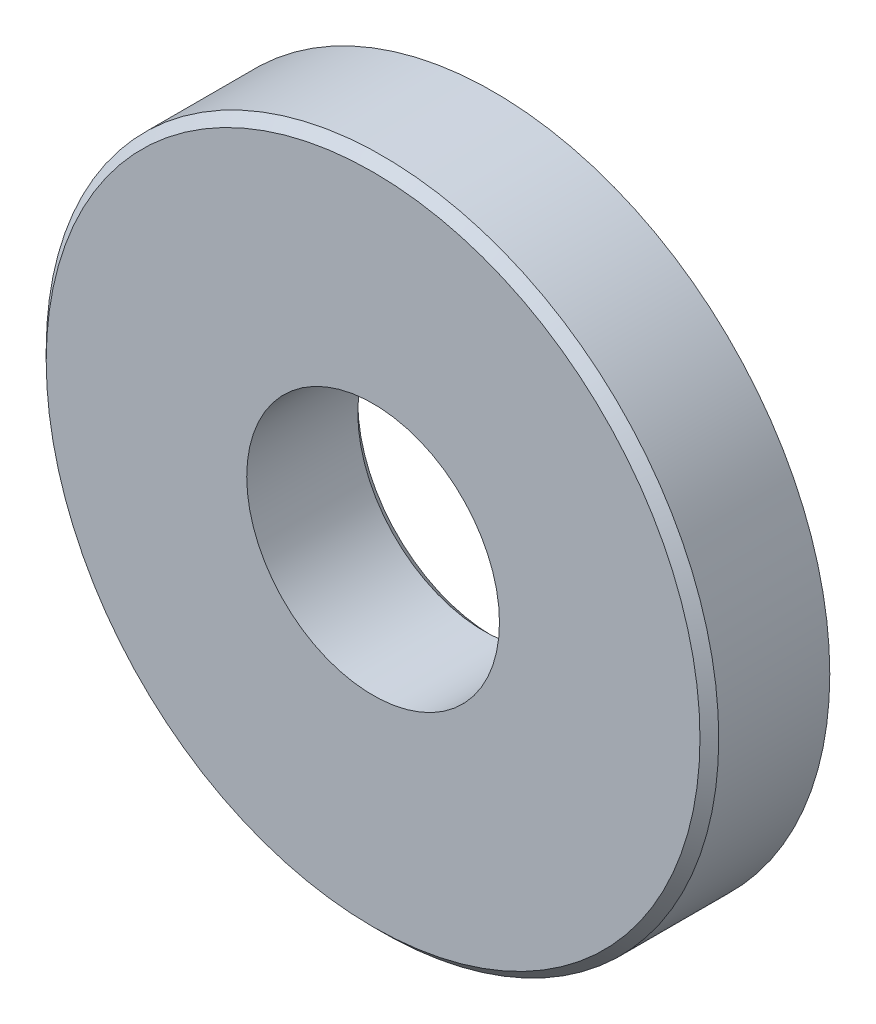
ISO-10303-21;
HEADER;
FILE_DESCRIPTION(('STEP AP214'),'2;1');
FILE_NAME('part.step','',(''),(''),'','','');
FILE_SCHEMA(('AUTOMOTIVE_DESIGN { 1 0 10303 214 1 1 1 1 }'));
ENDSEC;
DATA;
#1=APPLICATION_CONTEXT('core data for automotive mechanical design processes');
#2=APPLICATION_PROTOCOL_DEFINITION('international standard','automotive_design',2000,#1);
#3=PRODUCT_CONTEXT('',#1,'mechanical');
#4=PRODUCT('Part','Part','',(#3));
#5=PRODUCT_RELATED_PRODUCT_CATEGORY('part','',(#4));
#6=PRODUCT_DEFINITION_FORMATION('','',#4);
#7=PRODUCT_DEFINITION_CONTEXT('part definition',#1,'design');
#8=PRODUCT_DEFINITION('design','',#6,#7);
#9=PRODUCT_DEFINITION_SHAPE('','',#8);
#10=(LENGTH_UNIT() NAMED_UNIT(*) SI_UNIT(.MILLI.,.METRE.));
#11=(NAMED_UNIT(*) PLANE_ANGLE_UNIT() SI_UNIT($,.RADIAN.));
#12=(NAMED_UNIT(*) SI_UNIT($,.STERADIAN.) SOLID_ANGLE_UNIT());
#13=UNCERTAINTY_MEASURE_WITH_UNIT(LENGTH_MEASURE(1.E-05),#10,'distance_accuracy_value','');
#14=(GEOMETRIC_REPRESENTATION_CONTEXT(3) GLOBAL_UNCERTAINTY_ASSIGNED_CONTEXT((#13)) GLOBAL_UNIT_ASSIGNED_CONTEXT((#10,
#11,#12)) REPRESENTATION_CONTEXT('',''));
#15=CARTESIAN_POINT('',(0.,0.,0.));
#16=DIRECTION('',(0.,0.,1.));
#17=DIRECTION('',(1.,0.,0.));
#18=AXIS2_PLACEMENT_3D('',#15,#16,#17);
#19=CARTESIAN_POINT('',(0.,0.,3.85));
#20=DIRECTION('',(0.,0.,1.));
#21=DIRECTION('',(1.,0.,0.));
#22=AXIS2_PLACEMENT_3D('',#19,#20,#21);
#23=PLANE('',#22);
#24=CARTESIAN_POINT('',(0.,0.,3.85));
#25=DIRECTION('',(0.,0.,1.));
#26=DIRECTION('',(1.,0.,0.));
#27=AXIS2_PLACEMENT_3D('',#24,#25,#26);
#28=CIRCLE('',#27,10.45);
#29=CARTESIAN_POINT('',(10.45,0.,3.85));
#30=VERTEX_POINT('',#29);
#31=EDGE_CURVE('E66',#30,#30,#28,.T.);
#32=ORIENTED_EDGE('',*,*,#31,.T.);
#33=EDGE_LOOP('',(#32));
#34=FACE_BOUND('',#33,.T.);
#35=CARTESIAN_POINT('',(0.,0.,3.85));
#36=DIRECTION('',(0.,0.,1.));
#37=DIRECTION('',(1.,0.,0.));
#38=AXIS2_PLACEMENT_3D('',#35,#36,#37);
#39=CIRCLE('',#38,4.04);
#40=CARTESIAN_POINT('',(4.04,0.,3.85));
#41=VERTEX_POINT('',#40);
#42=EDGE_CURVE('E74',#41,#41,#39,.T.);
#43=ORIENTED_EDGE('',*,*,#42,.F.);
#44=EDGE_LOOP('',(#43));
#45=FACE_BOUND('',#44,.T.);
#46=ADVANCED_FACE('F43',(#34,#45),#23,.T.);
#47=CARTESIAN_POINT('',(0.,0.,0.));
#48=DIRECTION('',(0.,0.,1.));
#49=DIRECTION('',(1.,0.,0.));
#50=AXIS2_PLACEMENT_3D('',#47,#48,#49);
#51=PLANE('',#50);
#52=CARTESIAN_POINT('',(0.,0.,0.));
#53=DIRECTION('',(0.,0.,1.));
#54=DIRECTION('',(1.,0.,0.));
#55=AXIS2_PLACEMENT_3D('',#52,#53,#54);
#56=CIRCLE('',#55,4.33999999999999);
#57=CARTESIAN_POINT('',(4.33999999999999,0.,0.));
#58=VERTEX_POINT('',#57);
#59=EDGE_CURVE('E52',#58,#58,#56,.T.);
#60=ORIENTED_EDGE('',*,*,#59,.T.);
#61=EDGE_LOOP('',(#60));
#62=FACE_BOUND('',#61,.T.);
#63=CARTESIAN_POINT('',(0.,0.,0.));
#64=DIRECTION('',(0.,0.,1.));
#65=DIRECTION('',(1.,0.,0.));
#66=AXIS2_PLACEMENT_3D('',#63,#64,#65);
#67=CIRCLE('',#66,10.75);
#68=CARTESIAN_POINT('',(10.75,0.,0.));
#69=VERTEX_POINT('',#68);
#70=EDGE_CURVE('E71',#69,#69,#67,.T.);
#71=ORIENTED_EDGE('',*,*,#70,.F.);
#72=EDGE_LOOP('',(#71));
#73=FACE_BOUND('',#72,.T.);
#74=ADVANCED_FACE('F83',(#62,#73),#51,.F.);
#75=CARTESIAN_POINT('',(0.,0.,3.85));
#76=DIRECTION('',(0.,0.,-1.));
#77=DIRECTION('',(-1.,0.,0.));
#78=AXIS2_PLACEMENT_3D('',#75,#76,#77);
#79=CYLINDRICAL_SURFACE('',#78,10.75);
#80=CARTESIAN_POINT('',(0.,0.,3.55000000000002));
#81=DIRECTION('',(0.,0.,1.));
#82=DIRECTION('',(1.,0.,0.));
#83=AXIS2_PLACEMENT_3D('',#80,#81,#82);
#84=CIRCLE('',#83,10.75);
#85=CARTESIAN_POINT('',(10.75,0.,3.55000000000002));
#86=VERTEX_POINT('',#85);
#87=EDGE_CURVE('E60',#86,#86,#84,.F.);
#88=ORIENTED_EDGE('',*,*,#87,.T.);
#89=EDGE_LOOP('',(#88));
#90=FACE_BOUND('',#89,.T.);
#91=ORIENTED_EDGE('',*,*,#70,.T.);
#92=EDGE_LOOP('',(#91));
#93=FACE_BOUND('',#92,.T.);
#94=ADVANCED_FACE('F89',(#90,#93),#79,.T.);
#95=CARTESIAN_POINT('',(0.,0.,3.85));
#96=DIRECTION('',(0.,0.,-1.));
#97=DIRECTION('',(-1.,0.,0.));
#98=AXIS2_PLACEMENT_3D('',#95,#96,#97);
#99=CYLINDRICAL_SURFACE('',#98,4.04);
#100=CARTESIAN_POINT('',(0.,0.,0.29999999999999));
#101=DIRECTION('',(0.,0.,1.));
#102=DIRECTION('',(1.,0.,0.));
#103=AXIS2_PLACEMENT_3D('',#100,#101,#102);
#104=CIRCLE('',#103,4.04);
#105=CARTESIAN_POINT('',(4.04,0.,0.29999999999999));
#106=VERTEX_POINT('',#105);
#107=EDGE_CURVE('E10',#106,#106,#104,.F.);
#108=ORIENTED_EDGE('',*,*,#107,.T.);
#109=EDGE_LOOP('',(#108));
#110=FACE_BOUND('',#109,.T.);
#111=ORIENTED_EDGE('',*,*,#42,.T.);
#112=EDGE_LOOP('',(#111));
#113=FACE_BOUND('',#112,.T.);
#114=ADVANCED_FACE('F80',(#110,#113),#99,.F.);
#115=CARTESIAN_POINT('',(0.,0.,3.85));
#116=DIRECTION('',(0.,0.,-1.));
#117=DIRECTION('',(-1.,0.,0.));
#118=AXIS2_PLACEMENT_3D('',#115,#116,#117);
#119=CONICAL_SURFACE('',#118,10.45,0.785398163397451);
#120=ORIENTED_EDGE('',*,*,#87,.F.);
#121=EDGE_LOOP('',(#120));
#122=FACE_BOUND('',#121,.T.);
#123=ORIENTED_EDGE('',*,*,#31,.F.);
#124=EDGE_LOOP('',(#123));
#125=FACE_BOUND('',#124,.T.);
#126=ADVANCED_FACE('F96',(#122,#125),#119,.T.);
#127=CARTESIAN_POINT('',(0.,0.,0.));
#128=DIRECTION('',(0.,0.,-1.));
#129=DIRECTION('',(-1.,0.,0.));
#130=AXIS2_PLACEMENT_3D('',#127,#128,#129);
#131=CONICAL_SURFACE('',#130,4.33999999999999,0.785398163397445);
#132=ORIENTED_EDGE('',*,*,#107,.F.);
#133=EDGE_LOOP('',(#132));
#134=FACE_BOUND('',#133,.T.);
#135=ORIENTED_EDGE('',*,*,#59,.F.);
#136=EDGE_LOOP('',(#135));
#137=FACE_BOUND('',#136,.T.);
#138=ADVANCED_FACE('F46',(#134,#137),#131,.F.);
#139=CLOSED_SHELL('',(#46,#74,#94,#114,#126,#138));
#140=MANIFOLD_SOLID_BREP('B2',#139);
#141=ADVANCED_BREP_SHAPE_REPRESENTATION('',(#18,#140),#14);
#142=SHAPE_DEFINITION_REPRESENTATION(#9,#141);
ENDSEC;
END-ISO-10303-21;
